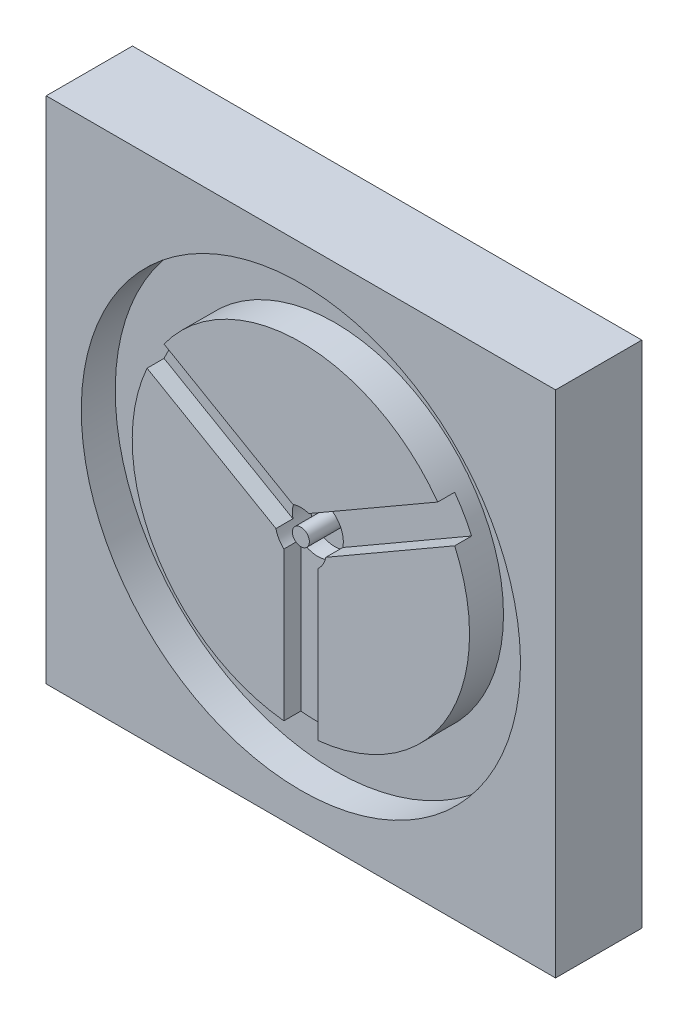
ISO-10303-21;
HEADER;
FILE_DESCRIPTION(('STEP AP214'),'2;1');
FILE_NAME('part.step','',(''),(''),'','','');
FILE_SCHEMA(('AUTOMOTIVE_DESIGN { 1 0 10303 214 1 1 1 1 }'));
ENDSEC;
DATA;
#1=APPLICATION_CONTEXT('core data for automotive mechanical design processes');
#2=APPLICATION_PROTOCOL_DEFINITION('international standard','automotive_design',2000,#1);
#3=PRODUCT_CONTEXT('',#1,'mechanical');
#4=PRODUCT('Part','Part','',(#3));
#5=PRODUCT_RELATED_PRODUCT_CATEGORY('part','',(#4));
#6=PRODUCT_DEFINITION_FORMATION('','',#4);
#7=PRODUCT_DEFINITION_CONTEXT('part definition',#1,'design');
#8=PRODUCT_DEFINITION('design','',#6,#7);
#9=PRODUCT_DEFINITION_SHAPE('','',#8);
#10=(LENGTH_UNIT() NAMED_UNIT(*) SI_UNIT(.MILLI.,.METRE.));
#11=(NAMED_UNIT(*) PLANE_ANGLE_UNIT() SI_UNIT($,.RADIAN.));
#12=(NAMED_UNIT(*) SI_UNIT($,.STERADIAN.) SOLID_ANGLE_UNIT());
#13=UNCERTAINTY_MEASURE_WITH_UNIT(LENGTH_MEASURE(1.E-05),#10,'distance_accuracy_value','');
#14=(GEOMETRIC_REPRESENTATION_CONTEXT(3) GLOBAL_UNCERTAINTY_ASSIGNED_CONTEXT((#13)) GLOBAL_UNIT_ASSIGNED_CONTEXT((#10,
#11,#12)) REPRESENTATION_CONTEXT('',''));
#15=CARTESIAN_POINT('',(0.,0.,0.));
#16=DIRECTION('',(0.,0.,1.));
#17=DIRECTION('',(1.,0.,0.));
#18=AXIS2_PLACEMENT_3D('',#15,#16,#17);
#19=CARTESIAN_POINT('',(0.,0.,0.));
#20=DIRECTION('',(0.,0.,-1.));
#21=DIRECTION('',(-1.,0.,0.));
#22=AXIS2_PLACEMENT_3D('',#19,#20,#21);
#23=PLANE('',#22);
#24=CARTESIAN_POINT('',(0.,0.,0.));
#25=DIRECTION('',(0.,0.,1.));
#26=DIRECTION('',(0.,-1.,0.));
#27=AXIS2_PLACEMENT_3D('',#24,#25,#26);
#28=CIRCLE('',#27,64.67);
#29=CARTESIAN_POINT('',(0.,-64.67,0.));
#30=VERTEX_POINT('',#29);
#31=EDGE_CURVE('E256',#30,#30,#28,.T.);
#32=ORIENTED_EDGE('',*,*,#31,.F.);
#33=EDGE_LOOP('',(#32));
#34=FACE_BOUND('',#33,.T.);
#35=DIRECTION('',(0.,1.,0.));
#36=VECTOR('',#35,1.);
#37=CARTESIAN_POINT('',(75.,-75.,0.));
#38=LINE('',#37,#36);
#39=CARTESIAN_POINT('',(75.,-75.,0.));
#40=VERTEX_POINT('',#39);
#41=CARTESIAN_POINT('',(75.,75.,0.));
#42=VERTEX_POINT('',#41);
#43=EDGE_CURVE('E165',#40,#42,#38,.T.);
#44=ORIENTED_EDGE('',*,*,#43,.T.);
#45=DIRECTION('',(-1.,0.,0.));
#46=VECTOR('',#45,1.);
#47=CARTESIAN_POINT('',(-75.,75.,0.));
#48=LINE('',#47,#46);
#49=CARTESIAN_POINT('',(-75.,75.,0.));
#50=VERTEX_POINT('',#49);
#51=EDGE_CURVE('E284',#42,#50,#48,.T.);
#52=ORIENTED_EDGE('',*,*,#51,.T.);
#53=DIRECTION('',(0.,-1.,0.));
#54=VECTOR('',#53,1.);
#55=CARTESIAN_POINT('',(-75.,-75.,0.));
#56=LINE('',#55,#54);
#57=CARTESIAN_POINT('',(-75.,-75.,0.));
#58=VERTEX_POINT('',#57);
#59=EDGE_CURVE('E287',#50,#58,#56,.T.);
#60=ORIENTED_EDGE('',*,*,#59,.T.);
#61=DIRECTION('',(1.,0.,0.));
#62=VECTOR('',#61,1.);
#63=CARTESIAN_POINT('',(-75.,-75.,0.));
#64=LINE('',#63,#62);
#65=EDGE_CURVE('E273',#58,#40,#64,.T.);
#66=ORIENTED_EDGE('',*,*,#65,.T.);
#67=EDGE_LOOP('',(#44,#52,#60,#66));
#68=FACE_BOUND('',#67,.T.);
#69=ADVANCED_FACE('F40',(#34,#68),#23,.F.);
#70=CARTESIAN_POINT('',(75.,-75.,-25.4));
#71=DIRECTION('',(1.,0.,0.));
#72=DIRECTION('',(0.,0.,-1.));
#73=AXIS2_PLACEMENT_3D('',#70,#71,#72);
#74=PLANE('',#73);
#75=ORIENTED_EDGE('',*,*,#43,.F.);
#76=DIRECTION('',(0.,0.,1.));
#77=VECTOR('',#76,1.);
#78=CARTESIAN_POINT('',(75.,-75.,-25.4));
#79=LINE('',#78,#77);
#80=CARTESIAN_POINT('',(75.,-75.,-25.4));
#81=VERTEX_POINT('',#80);
#82=EDGE_CURVE('E11',#81,#40,#79,.T.);
#83=ORIENTED_EDGE('',*,*,#82,.F.);
#84=DIRECTION('',(0.,1.,0.));
#85=VECTOR('',#84,1.);
#86=CARTESIAN_POINT('',(75.,-75.,-25.4));
#87=LINE('',#86,#85);
#88=CARTESIAN_POINT('',(75.,75.,-25.4));
#89=VERTEX_POINT('',#88);
#90=EDGE_CURVE('E269',#81,#89,#87,.T.);
#91=ORIENTED_EDGE('',*,*,#90,.T.);
#92=DIRECTION('',(0.,0.,1.));
#93=VECTOR('',#92,1.);
#94=CARTESIAN_POINT('',(75.,75.,-25.4));
#95=LINE('',#94,#93);
#96=EDGE_CURVE('E44',#89,#42,#95,.T.);
#97=ORIENTED_EDGE('',*,*,#96,.T.);
#98=EDGE_LOOP('',(#75,#83,#91,#97));
#99=FACE_BOUND('',#98,.T.);
#100=ADVANCED_FACE('F42',(#99),#74,.T.);
#101=CARTESIAN_POINT('',(-75.,-75.,-25.4));
#102=DIRECTION('',(0.,-1.,0.));
#103=DIRECTION('',(0.,0.,-1.));
#104=AXIS2_PLACEMENT_3D('',#101,#102,#103);
#105=PLANE('',#104);
#106=ORIENTED_EDGE('',*,*,#65,.F.);
#107=DIRECTION('',(0.,0.,1.));
#108=VECTOR('',#107,1.);
#109=CARTESIAN_POINT('',(-75.,-75.,-25.4));
#110=LINE('',#109,#108);
#111=CARTESIAN_POINT('',(-75.,-75.,-25.4));
#112=VERTEX_POINT('',#111);
#113=EDGE_CURVE('E49',#112,#58,#110,.T.);
#114=ORIENTED_EDGE('',*,*,#113,.F.);
#115=DIRECTION('',(1.,0.,0.));
#116=VECTOR('',#115,1.);
#117=CARTESIAN_POINT('',(-75.,-75.,-25.4));
#118=LINE('',#117,#116);
#119=EDGE_CURVE('E279',#112,#81,#118,.T.);
#120=ORIENTED_EDGE('',*,*,#119,.T.);
#121=ORIENTED_EDGE('',*,*,#82,.T.);
#122=EDGE_LOOP('',(#106,#114,#120,#121));
#123=FACE_BOUND('',#122,.T.);
#124=ADVANCED_FACE('F304',(#123),#105,.T.);
#125=CARTESIAN_POINT('',(-75.,-75.,-25.4));
#126=DIRECTION('',(-1.,0.,0.));
#127=DIRECTION('',(0.,0.,1.));
#128=AXIS2_PLACEMENT_3D('',#125,#126,#127);
#129=PLANE('',#128);
#130=ORIENTED_EDGE('',*,*,#59,.F.);
#131=DIRECTION('',(0.,0.,1.));
#132=VECTOR('',#131,1.);
#133=CARTESIAN_POINT('',(-75.,75.,-25.4));
#134=LINE('',#133,#132);
#135=CARTESIAN_POINT('',(-75.,75.,-25.4));
#136=VERTEX_POINT('',#135);
#137=EDGE_CURVE('E292',#136,#50,#134,.T.);
#138=ORIENTED_EDGE('',*,*,#137,.F.);
#139=DIRECTION('',(0.,-1.,0.));
#140=VECTOR('',#139,1.);
#141=CARTESIAN_POINT('',(-75.,-75.,-25.4));
#142=LINE('',#141,#140);
#143=EDGE_CURVE('E276',#136,#112,#142,.T.);
#144=ORIENTED_EDGE('',*,*,#143,.T.);
#145=ORIENTED_EDGE('',*,*,#113,.T.);
#146=EDGE_LOOP('',(#130,#138,#144,#145));
#147=FACE_BOUND('',#146,.T.);
#148=ADVANCED_FACE('F310',(#147),#129,.T.);
#149=CARTESIAN_POINT('',(-75.,75.,-25.4));
#150=DIRECTION('',(0.,1.,0.));
#151=DIRECTION('',(0.,0.,1.));
#152=AXIS2_PLACEMENT_3D('',#149,#150,#151);
#153=PLANE('',#152);
#154=ORIENTED_EDGE('',*,*,#51,.F.);
#155=ORIENTED_EDGE('',*,*,#96,.F.);
#156=DIRECTION('',(-1.,0.,0.));
#157=VECTOR('',#156,1.);
#158=CARTESIAN_POINT('',(-75.,75.,-25.4));
#159=LINE('',#158,#157);
#160=EDGE_CURVE('E272',#89,#136,#159,.T.);
#161=ORIENTED_EDGE('',*,*,#160,.T.);
#162=ORIENTED_EDGE('',*,*,#137,.T.);
#163=EDGE_LOOP('',(#154,#155,#161,#162));
#164=FACE_BOUND('',#163,.T.);
#165=ADVANCED_FACE('F300',(#164),#153,.T.);
#166=CARTESIAN_POINT('',(0.,0.,-25.4));
#167=DIRECTION('',(0.,0.,-1.));
#168=DIRECTION('',(-1.,0.,0.));
#169=AXIS2_PLACEMENT_3D('',#166,#167,#168);
#170=PLANE('',#169);
#171=ORIENTED_EDGE('',*,*,#90,.F.);
#172=ORIENTED_EDGE('',*,*,#119,.F.);
#173=ORIENTED_EDGE('',*,*,#143,.F.);
#174=ORIENTED_EDGE('',*,*,#160,.F.);
#175=EDGE_LOOP('',(#171,#172,#173,#174));
#176=FACE_BOUND('',#175,.T.);
#177=ADVANCED_FACE('F307',(#176),#170,.T.);
#178=CARTESIAN_POINT('',(0.,0.,-10.));
#179=DIRECTION('',(0.,0.,1.));
#180=DIRECTION('',(0.,-1.,0.));
#181=AXIS2_PLACEMENT_3D('',#178,#179,#180);
#182=CYLINDRICAL_SURFACE('',#181,49.67);
#183=CARTESIAN_POINT('',(0.,0.,0.));
#184=DIRECTION('',(0.,0.,1.));
#185=DIRECTION('',(0.,-1.,0.));
#186=AXIS2_PLACEMENT_3D('',#183,#184,#185);
#187=CIRCLE('',#186,49.67);
#188=CARTESIAN_POINT('',(4.99999999999999,-49.4176982466808,0.));
#189=VERTEX_POINT('',#188);
#190=CARTESIAN_POINT('',(45.2969820781795,20.3787221044178,0.));
#191=VERTEX_POINT('',#190);
#192=EDGE_CURVE('E260',#189,#191,#187,.T.);
#193=ORIENTED_EDGE('',*,*,#192,.F.);
#194=DIRECTION('',(0.,0.,1.));
#195=VECTOR('',#194,1.);
#196=CARTESIAN_POINT('',(4.99999999999999,-49.4176982466808,-10.));
#197=LINE('',#196,#195);
#198=CARTESIAN_POINT('',(4.99999999999999,-49.4176982466808,-5.));
#199=VERTEX_POINT('',#198);
#200=EDGE_CURVE('E245',#199,#189,#197,.T.);
#201=ORIENTED_EDGE('',*,*,#200,.F.);
#202=CARTESIAN_POINT('',(0.,0.,-5.));
#203=DIRECTION('',(0.,0.,1.));
#204=DIRECTION('',(0.,-1.,0.));
#205=AXIS2_PLACEMENT_3D('',#202,#203,#204);
#206=CIRCLE('',#205,49.67);
#207=CARTESIAN_POINT('',(-4.99999999999999,-49.4176982466808,-5.));
#208=VERTEX_POINT('',#207);
#209=EDGE_CURVE('E259',#199,#208,#206,.F.);
#210=ORIENTED_EDGE('',*,*,#209,.T.);
#211=DIRECTION('',(0.,0.,1.));
#212=VECTOR('',#211,1.);
#213=CARTESIAN_POINT('',(-4.99999999999999,-49.4176982466808,-10.));
#214=LINE('',#213,#212);
#215=CARTESIAN_POINT('',(-4.99999999999999,-49.4176982466808,0.));
#216=VERTEX_POINT('',#215);
#217=EDGE_CURVE('E249',#216,#208,#214,.F.);
#218=ORIENTED_EDGE('',*,*,#217,.F.);
#219=CARTESIAN_POINT('',(-45.2969820781792,20.3787221044184,0.));
#220=VERTEX_POINT('',#219);
#221=EDGE_CURVE('E57',#220,#216,#187,.T.);
#222=ORIENTED_EDGE('',*,*,#221,.F.);
#223=DIRECTION('',(0.,0.,1.));
#224=VECTOR('',#223,1.);
#225=CARTESIAN_POINT('',(-45.2969820781792,20.3787221044184,-10.));
#226=LINE('',#225,#224);
#227=CARTESIAN_POINT('',(-45.2969820781792,20.3787221044184,-5.));
#228=VERTEX_POINT('',#227);
#229=EDGE_CURVE('E210',#228,#220,#226,.T.);
#230=ORIENTED_EDGE('',*,*,#229,.F.);
#231=CARTESIAN_POINT('',(0.,0.,-5.));
#232=DIRECTION('',(0.,0.,1.));
#233=DIRECTION('',(0.,-1.,0.));
#234=AXIS2_PLACEMENT_3D('',#231,#232,#233);
#235=CIRCLE('',#234,49.67);
#236=CARTESIAN_POINT('',(-40.2969820781792,29.0389761422628,-5.));
#237=VERTEX_POINT('',#236);
#238=EDGE_CURVE('E207',#228,#237,#235,.F.);
#239=ORIENTED_EDGE('',*,*,#238,.T.);
#240=DIRECTION('',(0.,0.,1.));
#241=VECTOR('',#240,1.);
#242=CARTESIAN_POINT('',(-40.2969820781792,29.0389761422628,-10.));
#243=LINE('',#242,#241);
#244=CARTESIAN_POINT('',(-40.2969820781792,29.0389761422628,0.));
#245=VERTEX_POINT('',#244);
#246=EDGE_CURVE('E212',#245,#237,#243,.F.);
#247=ORIENTED_EDGE('',*,*,#246,.F.);
#248=CARTESIAN_POINT('',(40.2969820781796,29.0389761422622,0.));
#249=VERTEX_POINT('',#248);
#250=EDGE_CURVE('E263',#249,#245,#187,.T.);
#251=ORIENTED_EDGE('',*,*,#250,.F.);
#252=DIRECTION('',(0.,0.,1.));
#253=VECTOR('',#252,1.);
#254=CARTESIAN_POINT('',(40.2969820781796,29.0389761422622,-10.));
#255=LINE('',#254,#253);
#256=CARTESIAN_POINT('',(40.2969820781796,29.0389761422622,-5.));
#257=VERTEX_POINT('',#256);
#258=EDGE_CURVE('E186',#257,#249,#255,.T.);
#259=ORIENTED_EDGE('',*,*,#258,.F.);
#260=CARTESIAN_POINT('',(0.,0.,-5.));
#261=DIRECTION('',(0.,0.,1.));
#262=DIRECTION('',(0.,-1.,0.));
#263=AXIS2_PLACEMENT_3D('',#260,#261,#262);
#264=CIRCLE('',#263,49.67);
#265=CARTESIAN_POINT('',(45.2969820781795,20.3787221044178,-5.));
#266=VERTEX_POINT('',#265);
#267=EDGE_CURVE('E171',#257,#266,#264,.F.);
#268=ORIENTED_EDGE('',*,*,#267,.T.);
#269=DIRECTION('',(0.,0.,1.));
#270=VECTOR('',#269,1.);
#271=CARTESIAN_POINT('',(45.2969820781795,20.3787221044178,-10.));
#272=LINE('',#271,#270);
#273=EDGE_CURVE('E188',#191,#266,#272,.F.);
#274=ORIENTED_EDGE('',*,*,#273,.F.);
#275=EDGE_LOOP('',(#193,#201,#210,#218,#222,#230,#239,#247,#251,#259,#268,#274));
#276=FACE_BOUND('',#275,.T.);
#277=CARTESIAN_POINT('',(0.,0.,-10.));
#278=DIRECTION('',(0.,0.,1.));
#279=DIRECTION('',(0.,-1.,0.));
#280=AXIS2_PLACEMENT_3D('',#277,#278,#279);
#281=CIRCLE('',#280,49.67);
#282=CARTESIAN_POINT('',(0.,-49.67,-10.));
#283=VERTEX_POINT('',#282);
#284=EDGE_CURVE('E252',#283,#283,#281,.T.);
#285=ORIENTED_EDGE('',*,*,#284,.T.);
#286=EDGE_LOOP('',(#285));
#287=FACE_BOUND('',#286,.T.);
#288=ADVANCED_FACE('F345',(#276,#287),#182,.T.);
#289=CARTESIAN_POINT('',(0.,0.,-10.));
#290=DIRECTION('',(0.,0.,1.));
#291=DIRECTION('',(0.,-1.,0.));
#292=AXIS2_PLACEMENT_3D('',#289,#290,#291);
#293=CYLINDRICAL_SURFACE('',#292,64.67);
#294=CARTESIAN_POINT('',(0.,0.,-10.));
#295=DIRECTION('',(0.,0.,1.));
#296=DIRECTION('',(0.,-1.,0.));
#297=AXIS2_PLACEMENT_3D('',#294,#295,#296);
#298=CIRCLE('',#297,64.67);
#299=CARTESIAN_POINT('',(0.,-64.67,-10.));
#300=VERTEX_POINT('',#299);
#301=EDGE_CURVE('E255',#300,#300,#298,.T.);
#302=ORIENTED_EDGE('',*,*,#301,.F.);
#303=EDGE_LOOP('',(#302));
#304=FACE_BOUND('',#303,.T.);
#305=ORIENTED_EDGE('',*,*,#31,.T.);
#306=EDGE_LOOP('',(#305));
#307=FACE_BOUND('',#306,.T.);
#308=ADVANCED_FACE('F403',(#304,#307),#293,.F.);
#309=CARTESIAN_POINT('',(0.,0.,-10.));
#310=DIRECTION('',(0.,0.,1.));
#311=DIRECTION('',(0.,-1.,0.));
#312=AXIS2_PLACEMENT_3D('',#309,#310,#311);
#313=PLANE('',#312);
#314=ORIENTED_EDGE('',*,*,#284,.F.);
#315=EDGE_LOOP('',(#314));
#316=FACE_BOUND('',#315,.T.);
#317=ORIENTED_EDGE('',*,*,#301,.T.);
#318=EDGE_LOOP('',(#317));
#319=FACE_BOUND('',#318,.T.);
#320=ADVANCED_FACE('F396',(#316,#319),#313,.T.);
#321=CARTESIAN_POINT('',(0.,0.,-5.));
#322=DIRECTION('',(0.,0.,1.));
#323=DIRECTION('',(0.,-1.,0.));
#324=AXIS2_PLACEMENT_3D('',#321,#322,#323);
#325=PLANE('',#324);
#326=DIRECTION('',(0.,-1.,0.));
#327=VECTOR('',#326,1.);
#328=CARTESIAN_POINT('',(-5.,-5.59016994374947,-5.));
#329=LINE('',#328,#327);
#330=CARTESIAN_POINT('',(-5.,-5.59016994374947,-5.));
#331=VERTEX_POINT('',#330);
#332=EDGE_CURVE('E231',#331,#208,#329,.T.);
#333=ORIENTED_EDGE('',*,*,#332,.T.);
#334=ORIENTED_EDGE('',*,*,#209,.F.);
#335=DIRECTION('',(0.,1.,0.));
#336=VECTOR('',#335,1.);
#337=CARTESIAN_POINT('',(5.,-5.59016994374947,-5.));
#338=LINE('',#337,#336);
#339=CARTESIAN_POINT('',(5.,-5.59016994374947,-5.));
#340=VERTEX_POINT('',#339);
#341=EDGE_CURVE('E234',#199,#340,#338,.T.);
#342=ORIENTED_EDGE('',*,*,#341,.T.);
#343=CARTESIAN_POINT('',(0.,0.,-5.));
#344=DIRECTION('',(0.,0.,1.));
#345=DIRECTION('',(0.,-1.,0.));
#346=AXIS2_PLACEMENT_3D('',#343,#344,#345);
#347=CIRCLE('',#346,7.5);
#348=EDGE_CURVE('E222',#331,#340,#347,.T.);
#349=ORIENTED_EDGE('',*,*,#348,.F.);
#350=EDGE_LOOP('',(#333,#334,#342,#349));
#351=FACE_BOUND('',#350,.T.);
#352=ADVANCED_FACE('F351',(#351),#325,.T.);
#353=CARTESIAN_POINT('',(-5.,-5.59016994374947,-5.));
#354=DIRECTION('',(-1.,0.,0.));
#355=DIRECTION('',(0.,-1.,0.));
#356=AXIS2_PLACEMENT_3D('',#353,#354,#355);
#357=PLANE('',#356);
#358=ORIENTED_EDGE('',*,*,#217,.T.);
#359=ORIENTED_EDGE('',*,*,#332,.F.);
#360=DIRECTION('',(0.,0.,1.));
#361=VECTOR('',#360,1.);
#362=CARTESIAN_POINT('',(-5.,-5.59016994374947,-5.));
#363=LINE('',#362,#361);
#364=CARTESIAN_POINT('',(-5.,-5.59016994374947,0.));
#365=VERTEX_POINT('',#364);
#366=EDGE_CURVE('E242',#331,#365,#363,.T.);
#367=ORIENTED_EDGE('',*,*,#366,.T.);
#368=DIRECTION('',(0.,-1.,0.));
#369=VECTOR('',#368,1.);
#370=CARTESIAN_POINT('',(-5.,-5.59016994374947,0.));
#371=LINE('',#370,#369);
#372=EDGE_CURVE('E230',#365,#216,#371,.T.);
#373=ORIENTED_EDGE('',*,*,#372,.T.);
#374=EDGE_LOOP('',(#358,#359,#367,#373));
#375=FACE_BOUND('',#374,.T.);
#376=ADVANCED_FACE('F355',(#375),#357,.F.);
#377=CARTESIAN_POINT('',(5.,-5.59016994374947,-5.));
#378=DIRECTION('',(1.,0.,0.));
#379=DIRECTION('',(0.,1.,0.));
#380=AXIS2_PLACEMENT_3D('',#377,#378,#379);
#381=PLANE('',#380);
#382=ORIENTED_EDGE('',*,*,#200,.T.);
#383=DIRECTION('',(0.,1.,0.));
#384=VECTOR('',#383,1.);
#385=CARTESIAN_POINT('',(5.,-5.59016994374947,0.));
#386=LINE('',#385,#384);
#387=CARTESIAN_POINT('',(5.,-5.59016994374947,0.));
#388=VERTEX_POINT('',#387);
#389=EDGE_CURVE('E235',#189,#388,#386,.T.);
#390=ORIENTED_EDGE('',*,*,#389,.T.);
#391=DIRECTION('',(0.,0.,1.));
#392=VECTOR('',#391,1.);
#393=CARTESIAN_POINT('',(5.,-5.59016994374947,-5.));
#394=LINE('',#393,#392);
#395=EDGE_CURVE('E238',#340,#388,#394,.T.);
#396=ORIENTED_EDGE('',*,*,#395,.F.);
#397=ORIENTED_EDGE('',*,*,#341,.F.);
#398=EDGE_LOOP('',(#382,#390,#396,#397));
#399=FACE_BOUND('',#398,.T.);
#400=ADVANCED_FACE('F349',(#399),#381,.F.);
#401=CARTESIAN_POINT('',(0.,0.,-10.));
#402=DIRECTION('',(0.,0.,1.));
#403=DIRECTION('',(0.,-1.,0.));
#404=AXIS2_PLACEMENT_3D('',#401,#402,#403);
#405=CYLINDRICAL_SURFACE('',#404,2.5);
#406=CARTESIAN_POINT('',(0.,0.,-10.));
#407=DIRECTION('',(0.,0.,1.));
#408=DIRECTION('',(0.,-1.,0.));
#409=AXIS2_PLACEMENT_3D('',#406,#407,#408);
#410=CIRCLE('',#409,2.5);
#411=CARTESIAN_POINT('',(0.,-2.5,-10.));
#412=VERTEX_POINT('',#411);
#413=EDGE_CURVE('E216',#412,#412,#410,.T.);
#414=ORIENTED_EDGE('',*,*,#413,.T.);
#415=EDGE_LOOP('',(#414));
#416=FACE_BOUND('',#415,.T.);
#417=CARTESIAN_POINT('',(0.,0.,0.));
#418=DIRECTION('',(0.,0.,1.));
#419=DIRECTION('',(0.,-1.,0.));
#420=AXIS2_PLACEMENT_3D('',#417,#418,#419);
#421=CIRCLE('',#420,2.5);
#422=CARTESIAN_POINT('',(0.,-2.5,0.));
#423=VERTEX_POINT('',#422);
#424=EDGE_CURVE('E215',#423,#423,#421,.T.);
#425=ORIENTED_EDGE('',*,*,#424,.F.);
#426=EDGE_LOOP('',(#425));
#427=FACE_BOUND('',#426,.T.);
#428=ADVANCED_FACE('F390',(#416,#427),#405,.T.);
#429=CARTESIAN_POINT('',(0.,0.,-10.));
#430=DIRECTION('',(0.,0.,1.));
#431=DIRECTION('',(0.,-1.,0.));
#432=AXIS2_PLACEMENT_3D('',#429,#430,#431);
#433=CYLINDRICAL_SURFACE('',#432,7.5);
#434=DIRECTION('',(0.,0.,1.));
#435=VECTOR('',#434,1.);
#436=CARTESIAN_POINT('',(7.34122918275926,-1.53504204704753,-5.));
#437=LINE('',#436,#435);
#438=CARTESIAN_POINT('',(7.34122918275926,-1.53504204704753,-5.));
#439=VERTEX_POINT('',#438);
#440=CARTESIAN_POINT('',(7.34122918275926,-1.53504204704753,0.));
#441=VERTEX_POINT('',#440);
#442=EDGE_CURVE('E161',#439,#441,#437,.T.);
#443=ORIENTED_EDGE('',*,*,#442,.F.);
#444=CARTESIAN_POINT('',(0.,0.,-5.));
#445=DIRECTION('',(0.,0.,1.));
#446=DIRECTION('',(0.,-1.,0.));
#447=AXIS2_PLACEMENT_3D('',#444,#445,#446);
#448=CIRCLE('',#447,7.5);
#449=CARTESIAN_POINT('',(2.34122918275934,7.12521199079691,-5.));
#450=VERTEX_POINT('',#449);
#451=EDGE_CURVE('E154',#450,#439,#448,.F.);
#452=ORIENTED_EDGE('',*,*,#451,.F.);
#453=DIRECTION('',(0.,0.,1.));
#454=VECTOR('',#453,1.);
#455=CARTESIAN_POINT('',(2.34122918275934,7.12521199079691,-5.));
#456=LINE('',#455,#454);
#457=CARTESIAN_POINT('',(2.34122918275934,7.12521199079691,0.));
#458=VERTEX_POINT('',#457);
#459=EDGE_CURVE('E159',#450,#458,#456,.T.);
#460=ORIENTED_EDGE('',*,*,#459,.T.);
#461=CARTESIAN_POINT('',(0.,0.,0.));
#462=DIRECTION('',(0.,0.,1.));
#463=DIRECTION('',(0.,-1.,0.));
#464=AXIS2_PLACEMENT_3D('',#461,#462,#463);
#465=CIRCLE('',#464,7.5);
#466=CARTESIAN_POINT('',(-2.34122918275924,7.12521199079694,0.));
#467=VERTEX_POINT('',#466);
#468=EDGE_CURVE('E227',#458,#467,#465,.T.);
#469=ORIENTED_EDGE('',*,*,#468,.T.);
#470=DIRECTION('',(0.,0.,1.));
#471=VECTOR('',#470,1.);
#472=CARTESIAN_POINT('',(-2.34122918275924,7.12521199079694,-5.));
#473=LINE('',#472,#471);
#474=CARTESIAN_POINT('',(-2.34122918275924,7.12521199079694,-5.));
#475=VERTEX_POINT('',#474);
#476=EDGE_CURVE('E204',#475,#467,#473,.T.);
#477=ORIENTED_EDGE('',*,*,#476,.F.);
#478=CARTESIAN_POINT('',(0.,0.,-5.));
#479=DIRECTION('',(0.,0.,1.));
#480=DIRECTION('',(0.,-1.,0.));
#481=AXIS2_PLACEMENT_3D('',#478,#479,#480);
#482=CIRCLE('',#481,7.5);
#483=CARTESIAN_POINT('',(-7.34122918275928,-1.53504204704742,-5.));
#484=VERTEX_POINT('',#483);
#485=EDGE_CURVE('E166',#484,#475,#482,.F.);
#486=ORIENTED_EDGE('',*,*,#485,.F.);
#487=DIRECTION('',(0.,0.,1.));
#488=VECTOR('',#487,1.);
#489=CARTESIAN_POINT('',(-7.34122918275928,-1.53504204704742,-5.));
#490=LINE('',#489,#488);
#491=CARTESIAN_POINT('',(-7.34122918275928,-1.53504204704742,0.));
#492=VERTEX_POINT('',#491);
#493=EDGE_CURVE('E199',#484,#492,#490,.T.);
#494=ORIENTED_EDGE('',*,*,#493,.T.);
#495=EDGE_CURVE('E225',#492,#365,#465,.T.);
#496=ORIENTED_EDGE('',*,*,#495,.T.);
#497=ORIENTED_EDGE('',*,*,#366,.F.);
#498=ORIENTED_EDGE('',*,*,#348,.T.);
#499=ORIENTED_EDGE('',*,*,#395,.T.);
#500=EDGE_CURVE('E65',#388,#441,#465,.T.);
#501=ORIENTED_EDGE('',*,*,#500,.T.);
#502=EDGE_LOOP('',(#443,#452,#460,#469,#477,#486,#494,#496,#497,#498,#499,#501));
#503=FACE_BOUND('',#502,.T.);
#504=CARTESIAN_POINT('',(0.,0.,-10.));
#505=DIRECTION('',(0.,0.,1.));
#506=DIRECTION('',(0.,-1.,0.));
#507=AXIS2_PLACEMENT_3D('',#504,#505,#506);
#508=CIRCLE('',#507,7.5);
#509=CARTESIAN_POINT('',(0.,-7.5,-10.));
#510=VERTEX_POINT('',#509);
#511=EDGE_CURVE('E219',#510,#510,#508,.T.);
#512=ORIENTED_EDGE('',*,*,#511,.F.);
#513=EDGE_LOOP('',(#512));
#514=FACE_BOUND('',#513,.T.);
#515=ADVANCED_FACE('F156',(#503,#514),#433,.F.);
#516=CARTESIAN_POINT('',(0.,0.,-10.));
#517=DIRECTION('',(0.,0.,1.));
#518=DIRECTION('',(0.,-1.,0.));
#519=AXIS2_PLACEMENT_3D('',#516,#517,#518);
#520=PLANE('',#519);
#521=ORIENTED_EDGE('',*,*,#413,.F.);
#522=EDGE_LOOP('',(#521));
#523=FACE_BOUND('',#522,.T.);
#524=ORIENTED_EDGE('',*,*,#511,.T.);
#525=EDGE_LOOP('',(#524));
#526=FACE_BOUND('',#525,.T.);
#527=ADVANCED_FACE('F384',(#523,#526),#520,.T.);
#528=CARTESIAN_POINT('',(-2.34122918275924,7.12521199079694,-5.));
#529=DIRECTION('',(0.500000000000004,0.866025403784436,0.));
#530=DIRECTION('',(-0.866025403784436,0.500000000000004,0.));
#531=AXIS2_PLACEMENT_3D('',#528,#529,#530);
#532=PLANE('',#531);
#533=ORIENTED_EDGE('',*,*,#246,.T.);
#534=DIRECTION('',(-0.866025403784436,0.500000000000004,0.));
#535=VECTOR('',#534,1.);
#536=CARTESIAN_POINT('',(-2.34122918275924,7.12521199079694,-5.));
#537=LINE('',#536,#535);
#538=EDGE_CURVE('E192',#475,#237,#537,.T.);
#539=ORIENTED_EDGE('',*,*,#538,.F.);
#540=ORIENTED_EDGE('',*,*,#476,.T.);
#541=DIRECTION('',(-0.866025403784436,0.500000000000004,0.));
#542=VECTOR('',#541,1.);
#543=CARTESIAN_POINT('',(-2.34122918275924,7.12521199079694,0.));
#544=LINE('',#543,#542);
#545=EDGE_CURVE('E191',#467,#245,#544,.T.);
#546=ORIENTED_EDGE('',*,*,#545,.T.);
#547=EDGE_LOOP('',(#533,#539,#540,#546));
#548=FACE_BOUND('',#547,.T.);
#549=ADVANCED_FACE('F363',(#548),#532,.F.);
#550=CARTESIAN_POINT('',(-7.34122918275928,-1.53504204704742,-5.));
#551=DIRECTION('',(-0.500000000000004,-0.866025403784436,0.));
#552=DIRECTION('',(0.866025403784436,-0.500000000000004,0.));
#553=AXIS2_PLACEMENT_3D('',#550,#551,#552);
#554=PLANE('',#553);
#555=ORIENTED_EDGE('',*,*,#229,.T.);
#556=DIRECTION('',(0.866025403784436,-0.500000000000004,0.));
#557=VECTOR('',#556,1.);
#558=CARTESIAN_POINT('',(-7.34122918275928,-1.53504204704742,0.));
#559=LINE('',#558,#557);
#560=EDGE_CURVE('E196',#220,#492,#559,.T.);
#561=ORIENTED_EDGE('',*,*,#560,.T.);
#562=ORIENTED_EDGE('',*,*,#493,.F.);
#563=DIRECTION('',(0.866025403784436,-0.500000000000004,0.));
#564=VECTOR('',#563,1.);
#565=CARTESIAN_POINT('',(-7.34122918275928,-1.53504204704742,-5.));
#566=LINE('',#565,#564);
#567=EDGE_CURVE('E195',#228,#484,#566,.T.);
#568=ORIENTED_EDGE('',*,*,#567,.F.);
#569=EDGE_LOOP('',(#555,#561,#562,#568));
#570=FACE_BOUND('',#569,.T.);
#571=ADVANCED_FACE('F367',(#570),#554,.F.);
#572=CARTESIAN_POINT('',(0.,0.,-5.));
#573=DIRECTION('',(0.,0.,1.));
#574=DIRECTION('',(-0.866025403784436,0.500000000000004,0.));
#575=AXIS2_PLACEMENT_3D('',#572,#573,#574);
#576=PLANE('',#575);
#577=ORIENTED_EDGE('',*,*,#567,.T.);
#578=ORIENTED_EDGE('',*,*,#485,.T.);
#579=ORIENTED_EDGE('',*,*,#538,.T.);
#580=ORIENTED_EDGE('',*,*,#238,.F.);
#581=EDGE_LOOP('',(#577,#578,#579,#580));
#582=FACE_BOUND('',#581,.T.);
#583=ADVANCED_FACE('F369',(#582),#576,.T.);
#584=CARTESIAN_POINT('',(7.34122918275926,-1.53504204704753,-5.));
#585=DIRECTION('',(0.499999999999992,-0.866025403784443,0.));
#586=DIRECTION('',(0.866025403784443,0.499999999999992,0.));
#587=AXIS2_PLACEMENT_3D('',#584,#585,#586);
#588=PLANE('',#587);
#589=ORIENTED_EDGE('',*,*,#273,.T.);
#590=DIRECTION('',(0.866025403784443,0.499999999999992,0.));
#591=VECTOR('',#590,1.);
#592=CARTESIAN_POINT('',(7.34122918275926,-1.53504204704753,-5.));
#593=LINE('',#592,#591);
#594=EDGE_CURVE('E175',#439,#266,#593,.T.);
#595=ORIENTED_EDGE('',*,*,#594,.F.);
#596=ORIENTED_EDGE('',*,*,#442,.T.);
#597=DIRECTION('',(0.866025403784443,0.499999999999992,0.));
#598=VECTOR('',#597,1.);
#599=CARTESIAN_POINT('',(7.34122918275926,-1.53504204704753,0.));
#600=LINE('',#599,#598);
#601=EDGE_CURVE('E343',#441,#191,#600,.T.);
#602=ORIENTED_EDGE('',*,*,#601,.T.);
#603=EDGE_LOOP('',(#589,#595,#596,#602));
#604=FACE_BOUND('',#603,.T.);
#605=ADVANCED_FACE('F371',(#604),#588,.F.);
#606=CARTESIAN_POINT('',(2.34122918275934,7.12521199079691,-5.));
#607=DIRECTION('',(-0.499999999999992,0.866025403784443,0.));
#608=DIRECTION('',(-0.866025403784443,-0.499999999999992,0.));
#609=AXIS2_PLACEMENT_3D('',#606,#607,#608);
#610=PLANE('',#609);
#611=ORIENTED_EDGE('',*,*,#258,.T.);
#612=DIRECTION('',(-0.866025403784443,-0.499999999999992,0.));
#613=VECTOR('',#612,1.);
#614=CARTESIAN_POINT('',(2.34122918275934,7.12521199079691,0.));
#615=LINE('',#614,#613);
#616=EDGE_CURVE('E179',#249,#458,#615,.T.);
#617=ORIENTED_EDGE('',*,*,#616,.T.);
#618=ORIENTED_EDGE('',*,*,#459,.F.);
#619=DIRECTION('',(-0.866025403784443,-0.499999999999992,0.));
#620=VECTOR('',#619,1.);
#621=CARTESIAN_POINT('',(2.34122918275934,7.12521199079691,-5.));
#622=LINE('',#621,#620);
#623=EDGE_CURVE('E169',#257,#450,#622,.T.);
#624=ORIENTED_EDGE('',*,*,#623,.F.);
#625=EDGE_LOOP('',(#611,#617,#618,#624));
#626=FACE_BOUND('',#625,.T.);
#627=ADVANCED_FACE('F177',(#626),#610,.F.);
#628=CARTESIAN_POINT('',(0.,0.,-5.));
#629=DIRECTION('',(0.,0.,1.));
#630=DIRECTION('',(0.866025403784443,0.499999999999992,0.));
#631=AXIS2_PLACEMENT_3D('',#628,#629,#630);
#632=PLANE('',#631);
#633=ORIENTED_EDGE('',*,*,#623,.T.);
#634=ORIENTED_EDGE('',*,*,#451,.T.);
#635=ORIENTED_EDGE('',*,*,#594,.T.);
#636=ORIENTED_EDGE('',*,*,#267,.F.);
#637=EDGE_LOOP('',(#633,#634,#635,#636));
#638=FACE_BOUND('',#637,.T.);
#639=ADVANCED_FACE('F170',(#638),#632,.T.);
#640=ORIENTED_EDGE('',*,*,#192,.T.);
#641=ORIENTED_EDGE('',*,*,#601,.F.);
#642=ORIENTED_EDGE('',*,*,#500,.F.);
#643=ORIENTED_EDGE('',*,*,#389,.F.);
#644=EDGE_LOOP('',(#640,#641,#642,#643));
#645=FACE_BOUND('',#644,.T.);
#646=ADVANCED_FACE('F322',(#645),#23,.F.);
#647=ORIENTED_EDGE('',*,*,#221,.T.);
#648=ORIENTED_EDGE('',*,*,#372,.F.);
#649=ORIENTED_EDGE('',*,*,#495,.F.);
#650=ORIENTED_EDGE('',*,*,#560,.F.);
#651=EDGE_LOOP('',(#647,#648,#649,#650));
#652=FACE_BOUND('',#651,.T.);
#653=ADVANCED_FACE('F332',(#652),#23,.F.);
#654=ORIENTED_EDGE('',*,*,#424,.T.);
#655=EDGE_LOOP('',(#654));
#656=FACE_BOUND('',#655,.T.);
#657=ADVANCED_FACE('F329',(#656),#23,.F.);
#658=ORIENTED_EDGE('',*,*,#250,.T.);
#659=ORIENTED_EDGE('',*,*,#545,.F.);
#660=ORIENTED_EDGE('',*,*,#468,.F.);
#661=ORIENTED_EDGE('',*,*,#616,.F.);
#662=EDGE_LOOP('',(#658,#659,#660,#661));
#663=FACE_BOUND('',#662,.T.);
#664=ADVANCED_FACE('F321',(#663),#23,.F.);
#665=CLOSED_SHELL('',(#69,#100,#124,#148,#165,#177,#288,#308,#320,#352,#376,#400,#428,#515,#527,
#549,#571,#583,#605,#627,#639,#646,#653,#657,#664));
#666=MANIFOLD_SOLID_BREP('B2',#665);
#667=ADVANCED_BREP_SHAPE_REPRESENTATION('',(#18,#666),#14);
#668=SHAPE_DEFINITION_REPRESENTATION(#9,#667);
ENDSEC;
END-ISO-10303-21;
